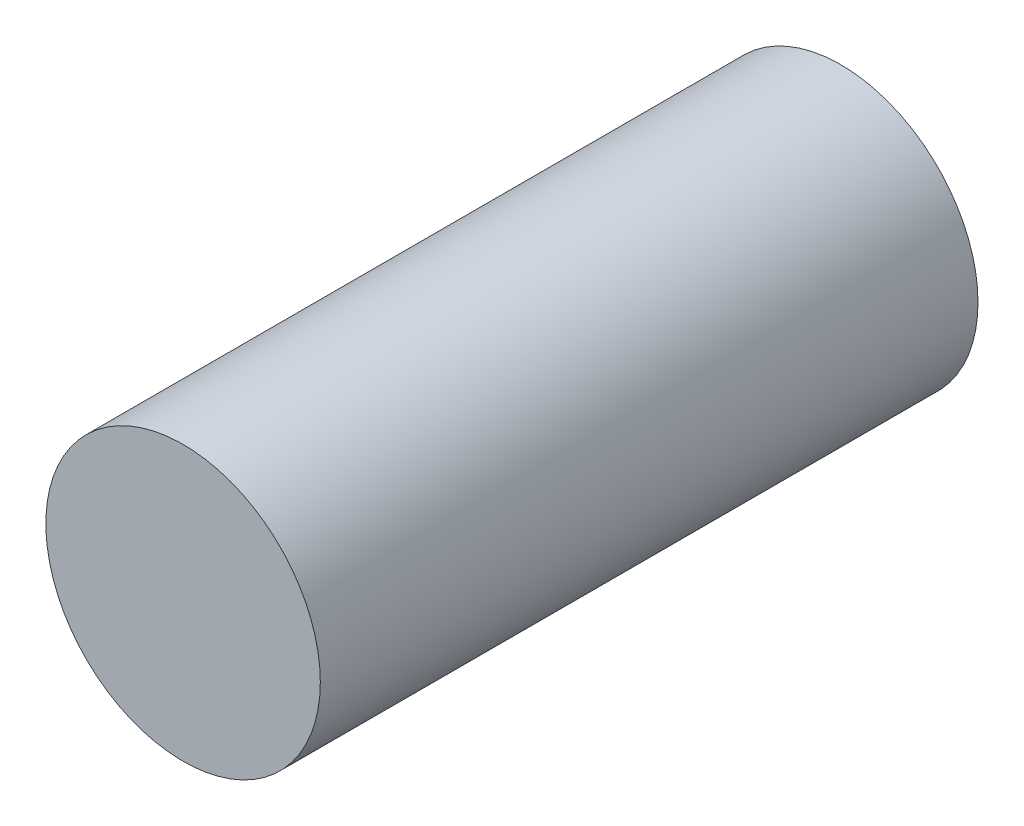
ISO-10303-21;
HEADER;
FILE_DESCRIPTION(('STEP AP214'),'2;1');
FILE_NAME('part.step','',(''),(''),'','','');
FILE_SCHEMA(('AUTOMOTIVE_DESIGN { 1 0 10303 214 1 1 1 1 }'));
ENDSEC;
DATA;
#1=APPLICATION_CONTEXT('core data for automotive mechanical design processes');
#2=APPLICATION_PROTOCOL_DEFINITION('international standard','automotive_design',2000,#1);
#3=PRODUCT_CONTEXT('',#1,'mechanical');
#4=PRODUCT('Part','Part','',(#3));
#5=PRODUCT_RELATED_PRODUCT_CATEGORY('part','',(#4));
#6=PRODUCT_DEFINITION_FORMATION('','',#4);
#7=PRODUCT_DEFINITION_CONTEXT('part definition',#1,'design');
#8=PRODUCT_DEFINITION('design','',#6,#7);
#9=PRODUCT_DEFINITION_SHAPE('','',#8);
#10=(LENGTH_UNIT() NAMED_UNIT(*) SI_UNIT(.MILLI.,.METRE.));
#11=(NAMED_UNIT(*) PLANE_ANGLE_UNIT() SI_UNIT($,.RADIAN.));
#12=(NAMED_UNIT(*) SI_UNIT($,.STERADIAN.) SOLID_ANGLE_UNIT());
#13=UNCERTAINTY_MEASURE_WITH_UNIT(LENGTH_MEASURE(1.E-05),#10,'distance_accuracy_value','');
#14=(GEOMETRIC_REPRESENTATION_CONTEXT(3) GLOBAL_UNCERTAINTY_ASSIGNED_CONTEXT((#13)) GLOBAL_UNIT_ASSIGNED_CONTEXT((#10,
#11,#12)) REPRESENTATION_CONTEXT('',''));
#15=CARTESIAN_POINT('',(0.,0.,0.));
#16=DIRECTION('',(0.,0.,1.));
#17=DIRECTION('',(1.,0.,0.));
#18=AXIS2_PLACEMENT_3D('',#15,#16,#17);
#19=CARTESIAN_POINT('',(0.,0.,76.2));
#20=DIRECTION('',(0.,0.,-1.));
#21=DIRECTION('',(-1.,0.,0.));
#22=AXIS2_PLACEMENT_3D('',#19,#20,#21);
#23=CYLINDRICAL_SURFACE('',#22,31.80207);
#24=CARTESIAN_POINT('',(0.,0.,76.2));
#25=DIRECTION('',(0.,0.,1.));
#26=DIRECTION('',(1.,0.,0.));
#27=AXIS2_PLACEMENT_3D('',#24,#25,#26);
#28=CIRCLE('',#27,31.80207);
#29=CARTESIAN_POINT('',(31.80207,0.,76.2));
#30=VERTEX_POINT('',#29);
#31=EDGE_CURVE('E10',#30,#30,#28,.T.);
#32=ORIENTED_EDGE('',*,*,#31,.F.);
#33=EDGE_LOOP('',(#32));
#34=FACE_BOUND('',#33,.T.);
#35=CARTESIAN_POINT('',(0.,0.,-76.2));
#36=DIRECTION('',(0.,0.,1.));
#37=DIRECTION('',(1.,0.,0.));
#38=AXIS2_PLACEMENT_3D('',#35,#36,#37);
#39=CIRCLE('',#38,31.80207);
#40=CARTESIAN_POINT('',(31.80207,0.,-76.2));
#41=VERTEX_POINT('',#40);
#42=EDGE_CURVE('E40',#41,#41,#39,.T.);
#43=ORIENTED_EDGE('',*,*,#42,.T.);
#44=EDGE_LOOP('',(#43));
#45=FACE_BOUND('',#44,.T.);
#46=ADVANCED_FACE('F34',(#34,#45),#23,.T.);
#47=CARTESIAN_POINT('',(0.,0.,76.2));
#48=DIRECTION('',(0.,0.,1.));
#49=DIRECTION('',(1.,0.,0.));
#50=AXIS2_PLACEMENT_3D('',#47,#48,#49);
#51=PLANE('',#50);
#52=ORIENTED_EDGE('',*,*,#31,.T.);
#53=EDGE_LOOP('',(#52));
#54=FACE_BOUND('',#53,.T.);
#55=ADVANCED_FACE('F49',(#54),#51,.T.);
#56=CARTESIAN_POINT('',(0.,0.,-76.2));
#57=DIRECTION('',(0.,0.,1.));
#58=DIRECTION('',(1.,0.,0.));
#59=AXIS2_PLACEMENT_3D('',#56,#57,#58);
#60=PLANE('',#59);
#61=ORIENTED_EDGE('',*,*,#42,.F.);
#62=EDGE_LOOP('',(#61));
#63=FACE_BOUND('',#62,.T.);
#64=ADVANCED_FACE('F47',(#63),#60,.F.);
#65=CLOSED_SHELL('',(#46,#55,#64));
#66=MANIFOLD_SOLID_BREP('B2',#65);
#67=ADVANCED_BREP_SHAPE_REPRESENTATION('',(#18,#66),#14);
#68=SHAPE_DEFINITION_REPRESENTATION(#9,#67);
ENDSEC;
END-ISO-10303-21;
